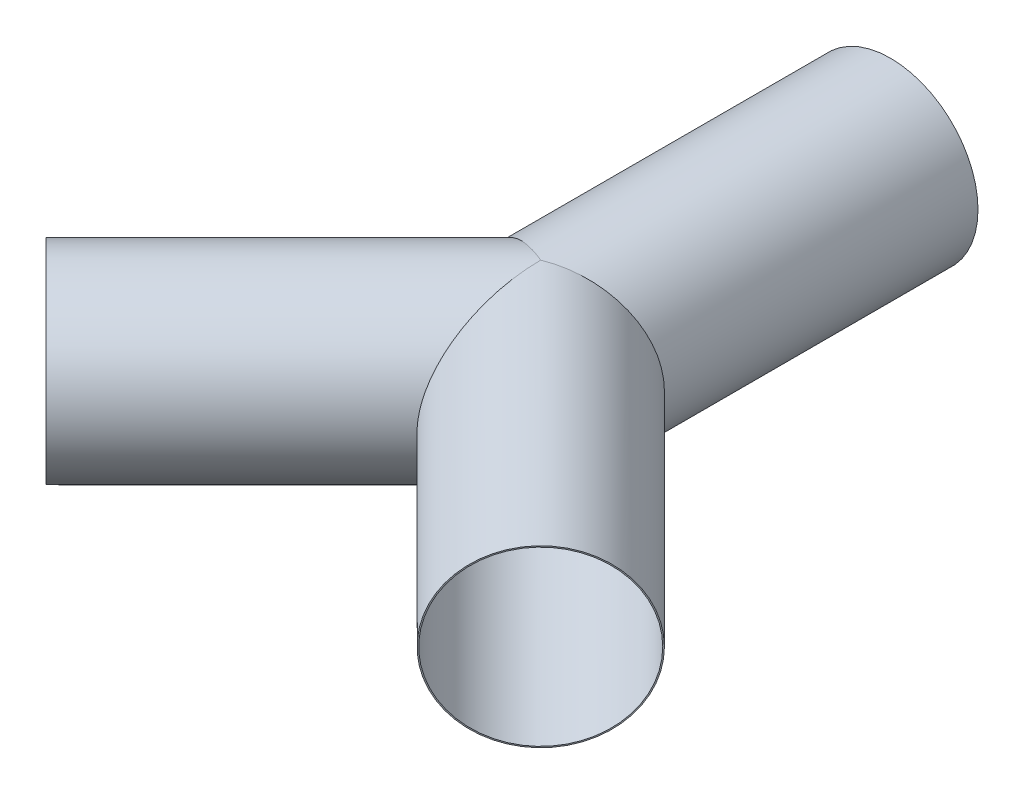
ISO-10303-21;
HEADER;
FILE_DESCRIPTION(('STEP AP214'),'2;1');
FILE_NAME('part.step','',(''),(''),'','','');
FILE_SCHEMA(('AUTOMOTIVE_DESIGN { 1 0 10303 214 1 1 1 1 }'));
ENDSEC;
DATA;
#1=APPLICATION_CONTEXT('core data for automotive mechanical design processes');
#2=APPLICATION_PROTOCOL_DEFINITION('international standard','automotive_design',2000,#1);
#3=PRODUCT_CONTEXT('',#1,'mechanical');
#4=PRODUCT('Part','Part','',(#3));
#5=PRODUCT_RELATED_PRODUCT_CATEGORY('part','',(#4));
#6=PRODUCT_DEFINITION_FORMATION('','',#4);
#7=PRODUCT_DEFINITION_CONTEXT('part definition',#1,'design');
#8=PRODUCT_DEFINITION('design','',#6,#7);
#9=PRODUCT_DEFINITION_SHAPE('','',#8);
#10=(LENGTH_UNIT() NAMED_UNIT(*) SI_UNIT(.MILLI.,.METRE.));
#11=(NAMED_UNIT(*) PLANE_ANGLE_UNIT() SI_UNIT($,.RADIAN.));
#12=(NAMED_UNIT(*) SI_UNIT($,.STERADIAN.) SOLID_ANGLE_UNIT());
#13=UNCERTAINTY_MEASURE_WITH_UNIT(LENGTH_MEASURE(1.E-05),#10,'distance_accuracy_value','');
#14=(GEOMETRIC_REPRESENTATION_CONTEXT(3) GLOBAL_UNCERTAINTY_ASSIGNED_CONTEXT((#13)) GLOBAL_UNIT_ASSIGNED_CONTEXT((#10,
#11,#12)) REPRESENTATION_CONTEXT('',''));
#15=CARTESIAN_POINT('',(0.,0.,0.));
#16=DIRECTION('',(0.,0.,1.));
#17=DIRECTION('',(1.,0.,0.));
#18=AXIS2_PLACEMENT_3D('',#15,#16,#17);
#19=CARTESIAN_POINT('',(0.,0.,0.));
#20=DIRECTION('',(0.,0.,-1.));
#21=DIRECTION('',(-1.,0.,0.));
#22=AXIS2_PLACEMENT_3D('',#19,#20,#21);
#23=CYLINDRICAL_SURFACE('',#22,150.);
#24=CARTESIAN_POINT('',(-1.99451502676699E-13,0.,2.2204460492503E-13));
#25=DIRECTION('',(0.382683432365092,0.,-0.923879532511286));
#26=DIRECTION('',(-0.923879532511286,0.,-0.382683432365092));
#27=AXIS2_PLACEMENT_3D('',#24,#25,#26);
#28=ELLIPSE('',#27,162.358830043859,150.);
#29=CARTESIAN_POINT('',(-1.99451502676699E-13,150.,2.2204460492503E-13));
#30=VERTEX_POINT('',#29);
#31=CARTESIAN_POINT('',(-1.31672195931703E-13,-150.,0.));
#32=VERTEX_POINT('',#31);
#33=EDGE_CURVE('E41',#30,#32,#28,.F.);
#34=ORIENTED_EDGE('',*,*,#33,.F.);
#35=CARTESIAN_POINT('',(0.,0.,-1.11022302462516E-13));
#36=DIRECTION('',(0.382683432365089,0.,0.923879532511287));
#37=DIRECTION('',(0.923879532511287,0.,-0.382683432365089));
#38=AXIS2_PLACEMENT_3D('',#35,#36,#37);
#39=ELLIPSE('',#38,162.358830043859,150.);
#40=EDGE_CURVE('E11',#30,#32,#39,.F.);
#41=ORIENTED_EDGE('',*,*,#40,.T.);
#42=EDGE_LOOP('',(#34,#41));
#43=FACE_BOUND('',#42,.T.);
#44=CARTESIAN_POINT('',(0.,0.,-600.));
#45=DIRECTION('',(0.,0.,1.));
#46=DIRECTION('',(1.,0.,0.));
#47=AXIS2_PLACEMENT_3D('',#44,#45,#46);
#48=CIRCLE('',#47,150.);
#49=CARTESIAN_POINT('',(150.,0.,-600.));
#50=VERTEX_POINT('',#49);
#51=EDGE_CURVE('E93',#50,#50,#48,.T.);
#52=ORIENTED_EDGE('',*,*,#51,.T.);
#53=EDGE_LOOP('',(#52));
#54=FACE_BOUND('',#53,.T.);
#55=ADVANCED_FACE('F34',(#43,#54),#23,.T.);
#56=CARTESIAN_POINT('',(0.,0.,-600.));
#57=DIRECTION('',(0.,0.,1.));
#58=DIRECTION('',(1.,0.,0.));
#59=AXIS2_PLACEMENT_3D('',#56,#57,#58);
#60=PLANE('',#59);
#61=CARTESIAN_POINT('',(0.,0.,-600.));
#62=DIRECTION('',(0.,0.,1.));
#63=DIRECTION('',(1.,0.,0.));
#64=AXIS2_PLACEMENT_3D('',#61,#62,#63);
#65=CIRCLE('',#64,148.);
#66=CARTESIAN_POINT('',(148.,0.,-600.));
#67=VERTEX_POINT('',#66);
#68=EDGE_CURVE('E71',#67,#67,#65,.T.);
#69=ORIENTED_EDGE('',*,*,#68,.T.);
#70=EDGE_LOOP('',(#69));
#71=FACE_BOUND('',#70,.T.);
#72=ORIENTED_EDGE('',*,*,#51,.F.);
#73=EDGE_LOOP('',(#72));
#74=FACE_BOUND('',#73,.T.);
#75=ADVANCED_FACE('F117',(#71,#74),#60,.F.);
#76=CARTESIAN_POINT('',(565.165042944958,0.,-565.165042944952));
#77=DIRECTION('',(-0.707106781186551,0.,0.707106781186544));
#78=DIRECTION('',(0.707106781186544,0.,0.707106781186551));
#79=AXIS2_PLACEMENT_3D('',#76,#77,#78);
#80=CYLINDRICAL_SURFACE('',#79,150.);
#81=CARTESIAN_POINT('',(0.,0.,-1.11022302462516E-13));
#82=DIRECTION('',(1.,0.,0.));
#83=DIRECTION('',(0.,0.,1.));
#84=AXIS2_PLACEMENT_3D('',#81,#82,#83);
#85=ELLIPSE('',#84,212.132034355964,150.);
#86=EDGE_CURVE('E87',#32,#30,#85,.F.);
#87=ORIENTED_EDGE('',*,*,#86,.T.);
#88=ORIENTED_EDGE('',*,*,#33,.T.);
#89=EDGE_LOOP('',(#87,#88));
#90=FACE_BOUND('',#89,.T.);
#91=CARTESIAN_POINT('',(-424.264068711931,0.,424.264068711926));
#92=DIRECTION('',(-0.707106781186551,0.,0.707106781186544));
#93=DIRECTION('',(0.707106781186544,0.,0.707106781186551));
#94=AXIS2_PLACEMENT_3D('',#91,#92,#93);
#95=CIRCLE('',#94,150.);
#96=CARTESIAN_POINT('',(-318.198051533949,0.,530.330085889909));
#97=VERTEX_POINT('',#96);
#98=EDGE_CURVE('E65',#97,#97,#95,.T.);
#99=ORIENTED_EDGE('',*,*,#98,.F.);
#100=EDGE_LOOP('',(#99));
#101=FACE_BOUND('',#100,.T.);
#102=ADVANCED_FACE('F96',(#90,#101),#80,.T.);
#103=CARTESIAN_POINT('',(-424.264068711931,0.,424.264068711926));
#104=DIRECTION('',(-0.707106781186551,0.,0.707106781186544));
#105=DIRECTION('',(0.707106781186544,0.,0.707106781186551));
#106=AXIS2_PLACEMENT_3D('',#103,#104,#105);
#107=PLANE('',#106);
#108=CARTESIAN_POINT('',(-424.264068711931,0.,424.264068711926));
#109=DIRECTION('',(-0.707106781186551,0.,0.707106781186544));
#110=DIRECTION('',(0.707106781186544,0.,0.707106781186551));
#111=AXIS2_PLACEMENT_3D('',#108,#109,#110);
#112=CIRCLE('',#111,148.);
#113=CARTESIAN_POINT('',(-319.612265096322,0.,528.915872327536));
#114=VERTEX_POINT('',#113);
#115=EDGE_CURVE('E76',#114,#114,#112,.T.);
#116=ORIENTED_EDGE('',*,*,#115,.F.);
#117=EDGE_LOOP('',(#116));
#118=FACE_BOUND('',#117,.T.);
#119=ORIENTED_EDGE('',*,*,#98,.T.);
#120=EDGE_LOOP('',(#119));
#121=FACE_BOUND('',#120,.T.);
#122=ADVANCED_FACE('F106',(#118,#121),#107,.T.);
#123=CARTESIAN_POINT('',(424.264068711928,0.,424.264068711929));
#124=DIRECTION('',(0.707106781186546,0.,0.707106781186549));
#125=DIRECTION('',(0.707106781186549,0.,-0.707106781186546));
#126=AXIS2_PLACEMENT_3D('',#123,#124,#125);
#127=PLANE('',#126);
#128=CARTESIAN_POINT('',(424.264068711928,0.,424.264068711929));
#129=DIRECTION('',(0.707106781186546,0.,0.707106781186549));
#130=DIRECTION('',(0.707106781186549,0.,-0.707106781186546));
#131=AXIS2_PLACEMENT_3D('',#128,#129,#130);
#132=CIRCLE('',#131,148.);
#133=CARTESIAN_POINT('',(528.915872327537,0.,319.61226509632));
#134=VERTEX_POINT('',#133);
#135=EDGE_CURVE('E75',#134,#134,#132,.T.);
#136=ORIENTED_EDGE('',*,*,#135,.F.);
#137=EDGE_LOOP('',(#136));
#138=FACE_BOUND('',#137,.T.);
#139=CARTESIAN_POINT('',(424.264068711928,0.,424.264068711929));
#140=DIRECTION('',(0.707106781186546,0.,0.707106781186549));
#141=DIRECTION('',(0.707106781186549,0.,-0.707106781186546));
#142=AXIS2_PLACEMENT_3D('',#139,#140,#141);
#143=CIRCLE('',#142,150.);
#144=CARTESIAN_POINT('',(530.33008588991,0.,318.198051533947));
#145=VERTEX_POINT('',#144);
#146=EDGE_CURVE('E90',#145,#145,#143,.T.);
#147=ORIENTED_EDGE('',*,*,#146,.T.);
#148=EDGE_LOOP('',(#147));
#149=FACE_BOUND('',#148,.T.);
#150=ADVANCED_FACE('F101',(#138,#149),#127,.T.);
#151=CARTESIAN_POINT('',(-375.,0.,-375.000000000001));
#152=DIRECTION('',(0.707106781186546,0.,0.707106781186549));
#153=DIRECTION('',(0.707106781186549,0.,-0.707106781186546));
#154=AXIS2_PLACEMENT_3D('',#151,#152,#153);
#155=CYLINDRICAL_SURFACE('',#154,150.);
#156=ORIENTED_EDGE('',*,*,#86,.F.);
#157=ORIENTED_EDGE('',*,*,#40,.F.);
#158=EDGE_LOOP('',(#156,#157));
#159=FACE_BOUND('',#158,.T.);
#160=ORIENTED_EDGE('',*,*,#146,.F.);
#161=EDGE_LOOP('',(#160));
#162=FACE_BOUND('',#161,.T.);
#163=ADVANCED_FACE('F98',(#159,#162),#155,.T.);
#164=CARTESIAN_POINT('',(0.,0.,0.));
#165=DIRECTION('',(0.,0.,-1.));
#166=DIRECTION('',(-1.,0.,0.));
#167=AXIS2_PLACEMENT_3D('',#164,#165,#166);
#168=CYLINDRICAL_SURFACE('',#167,148.);
#169=CARTESIAN_POINT('',(0.,0.,-1.11022302462516E-13));
#170=DIRECTION('',(-0.382683432365092,0.,0.923879532511286));
#171=DIRECTION('',(-0.923879532511286,0.,-0.382683432365092));
#172=AXIS2_PLACEMENT_3D('',#169,#170,#171);
#173=ELLIPSE('',#172,160.194045643275,148.);
#174=CARTESIAN_POINT('',(-2.25965609069056E-13,148.,1.70454457837798E-13));
#175=VERTEX_POINT('',#174);
#176=CARTESIAN_POINT('',(0.,-148.,0.));
#177=VERTEX_POINT('',#176);
#178=EDGE_CURVE('E61',#175,#177,#173,.T.);
#179=ORIENTED_EDGE('',*,*,#178,.T.);
#180=CARTESIAN_POINT('',(0.,0.,-1.11022302462516E-13));
#181=DIRECTION('',(-0.382683432365089,0.,-0.923879532511287));
#182=DIRECTION('',(0.923879532511287,0.,-0.382683432365089));
#183=AXIS2_PLACEMENT_3D('',#180,#181,#182);
#184=ELLIPSE('',#183,160.194045643274,148.);
#185=EDGE_CURVE('E57',#175,#177,#184,.T.);
#186=ORIENTED_EDGE('',*,*,#185,.F.);
#187=EDGE_LOOP('',(#179,#186));
#188=FACE_BOUND('',#187,.T.);
#189=ORIENTED_EDGE('',*,*,#68,.F.);
#190=EDGE_LOOP('',(#189));
#191=FACE_BOUND('',#190,.T.);
#192=ADVANCED_FACE('F59',(#188,#191),#168,.F.);
#193=CARTESIAN_POINT('',(565.165042944958,0.,-565.165042944952));
#194=DIRECTION('',(-0.707106781186551,0.,0.707106781186544));
#195=DIRECTION('',(0.707106781186544,0.,0.707106781186551));
#196=AXIS2_PLACEMENT_3D('',#193,#194,#195);
#197=CYLINDRICAL_SURFACE('',#196,148.);
#198=CARTESIAN_POINT('',(0.,0.,-1.11022302462516E-13));
#199=DIRECTION('',(1.,0.,0.));
#200=DIRECTION('',(0.,0.,1.));
#201=AXIS2_PLACEMENT_3D('',#198,#199,#200);
#202=ELLIPSE('',#201,209.303607231218,148.);
#203=EDGE_CURVE('E70',#177,#175,#202,.F.);
#204=ORIENTED_EDGE('',*,*,#203,.F.);
#205=ORIENTED_EDGE('',*,*,#178,.F.);
#206=EDGE_LOOP('',(#204,#205));
#207=FACE_BOUND('',#206,.T.);
#208=ORIENTED_EDGE('',*,*,#115,.T.);
#209=EDGE_LOOP('',(#208));
#210=FACE_BOUND('',#209,.T.);
#211=ADVANCED_FACE('F68',(#207,#210),#197,.F.);
#212=CARTESIAN_POINT('',(-375.,0.,-375.000000000001));
#213=DIRECTION('',(0.707106781186546,0.,0.707106781186549));
#214=DIRECTION('',(0.707106781186549,0.,-0.707106781186546));
#215=AXIS2_PLACEMENT_3D('',#212,#213,#214);
#216=CYLINDRICAL_SURFACE('',#215,148.);
#217=ORIENTED_EDGE('',*,*,#203,.T.);
#218=ORIENTED_EDGE('',*,*,#185,.T.);
#219=EDGE_LOOP('',(#217,#218));
#220=FACE_BOUND('',#219,.T.);
#221=ORIENTED_EDGE('',*,*,#135,.T.);
#222=EDGE_LOOP('',(#221));
#223=FACE_BOUND('',#222,.T.);
#224=ADVANCED_FACE('F73',(#220,#223),#216,.F.);
#225=CLOSED_SHELL('',(#55,#75,#102,#122,#150,#163,#192,#211,#224));
#226=MANIFOLD_SOLID_BREP('B2',#225);
#227=ADVANCED_BREP_SHAPE_REPRESENTATION('',(#18,#226),#14);
#228=SHAPE_DEFINITION_REPRESENTATION(#9,#227);
ENDSEC;
END-ISO-10303-21;
